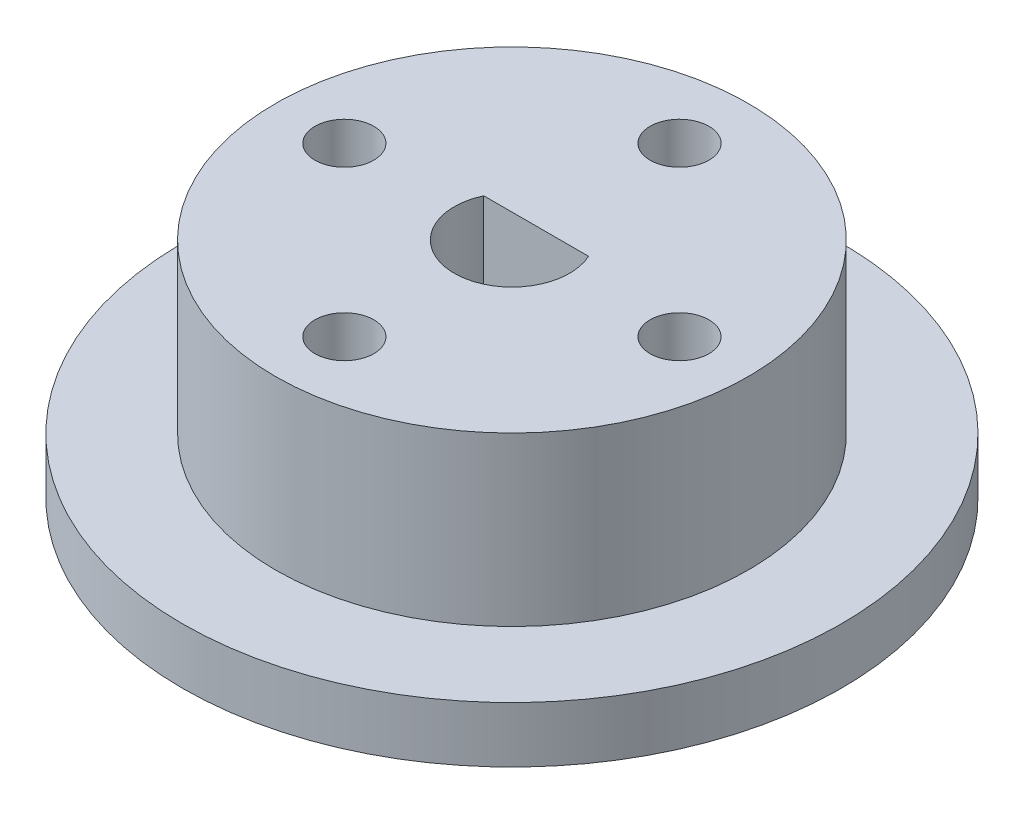
ISO-10303-21;
HEADER;
FILE_DESCRIPTION(('STEP AP214'),'2;1');
FILE_NAME('part.step','',(''),(''),'','','');
FILE_SCHEMA(('AUTOMOTIVE_DESIGN { 1 0 10303 214 1 1 1 1 }'));
ENDSEC;
DATA;
#1=APPLICATION_CONTEXT('core data for automotive mechanical design processes');
#2=APPLICATION_PROTOCOL_DEFINITION('international standard','automotive_design',2000,#1);
#3=PRODUCT_CONTEXT('',#1,'mechanical');
#4=PRODUCT('Part','Part','',(#3));
#5=PRODUCT_RELATED_PRODUCT_CATEGORY('part','',(#4));
#6=PRODUCT_DEFINITION_FORMATION('','',#4);
#7=PRODUCT_DEFINITION_CONTEXT('part definition',#1,'design');
#8=PRODUCT_DEFINITION('design','',#6,#7);
#9=PRODUCT_DEFINITION_SHAPE('','',#8);
#10=(LENGTH_UNIT() NAMED_UNIT(*) SI_UNIT(.MILLI.,.METRE.));
#11=(NAMED_UNIT(*) PLANE_ANGLE_UNIT() SI_UNIT($,.RADIAN.));
#12=(NAMED_UNIT(*) SI_UNIT($,.STERADIAN.) SOLID_ANGLE_UNIT());
#13=UNCERTAINTY_MEASURE_WITH_UNIT(LENGTH_MEASURE(1.E-05),#10,'distance_accuracy_value','');
#14=(GEOMETRIC_REPRESENTATION_CONTEXT(3) GLOBAL_UNCERTAINTY_ASSIGNED_CONTEXT((#13)) GLOBAL_UNIT_ASSIGNED_CONTEXT((#10,
#11,#12)) REPRESENTATION_CONTEXT('',''));
#15=CARTESIAN_POINT('',(0.,0.,0.));
#16=DIRECTION('',(0.,0.,1.));
#17=DIRECTION('',(1.,0.,0.));
#18=AXIS2_PLACEMENT_3D('',#15,#16,#17);
#19=CARTESIAN_POINT('',(0.,9.,0.));
#20=DIRECTION('',(0.,-1.,0.));
#21=DIRECTION('',(0.,0.,-1.));
#22=AXIS2_PLACEMENT_3D('',#19,#20,#21);
#23=CYLINDRICAL_SURFACE('',#22,3.1);
#24=DIRECTION('',(0.,-1.,0.));
#25=VECTOR('',#24,1.);
#26=CARTESIAN_POINT('',(-2.81424945589406,9.,-1.3));
#27=LINE('',#26,#25);
#28=CARTESIAN_POINT('',(-2.81424945589406,9.,-1.3));
#29=VERTEX_POINT('',#28);
#30=CARTESIAN_POINT('',(-2.81424945589406,2.5,-1.3));
#31=VERTEX_POINT('',#30);
#32=EDGE_CURVE('E55',#29,#31,#27,.T.);
#33=ORIENTED_EDGE('',*,*,#32,.F.);
#34=CARTESIAN_POINT('',(0.,9.,0.));
#35=DIRECTION('',(0.,1.,0.));
#36=DIRECTION('',(0.,0.,1.));
#37=AXIS2_PLACEMENT_3D('',#34,#35,#36);
#38=CIRCLE('',#37,3.1);
#39=CARTESIAN_POINT('',(2.81424945589406,9.,-1.3));
#40=VERTEX_POINT('',#39);
#41=EDGE_CURVE('E72',#29,#40,#38,.T.);
#42=ORIENTED_EDGE('',*,*,#41,.T.);
#43=DIRECTION('',(0.,-1.,0.));
#44=VECTOR('',#43,1.);
#45=CARTESIAN_POINT('',(2.81424945589406,9.,-1.3));
#46=LINE('',#45,#44);
#47=CARTESIAN_POINT('',(2.81424945589406,2.5,-1.3));
#48=VERTEX_POINT('',#47);
#49=EDGE_CURVE('E59',#48,#40,#46,.F.);
#50=ORIENTED_EDGE('',*,*,#49,.F.);
#51=CARTESIAN_POINT('',(0.,2.5,0.));
#52=DIRECTION('',(0.,-1.,0.));
#53=DIRECTION('',(0.,0.,-1.));
#54=AXIS2_PLACEMENT_3D('',#51,#52,#53);
#55=CIRCLE('',#54,3.1);
#56=EDGE_CURVE('E70',#48,#31,#55,.T.);
#57=ORIENTED_EDGE('',*,*,#56,.T.);
#58=EDGE_LOOP('',(#33,#42,#50,#57));
#59=FACE_BOUND('',#58,.T.);
#60=ADVANCED_FACE('F39',(#59),#23,.F.);
#61=CARTESIAN_POINT('',(0.,9.,0.));
#62=DIRECTION('',(0.,-1.,0.));
#63=DIRECTION('',(0.,0.,-1.));
#64=AXIS2_PLACEMENT_3D('',#61,#62,#63);
#65=CYLINDRICAL_SURFACE('',#64,12.7);
#66=CARTESIAN_POINT('',(0.,9.,0.));
#67=DIRECTION('',(0.,1.,0.));
#68=DIRECTION('',(0.,0.,1.));
#69=AXIS2_PLACEMENT_3D('',#66,#67,#68);
#70=CIRCLE('',#69,12.7);
#71=CARTESIAN_POINT('',(0.,9.,12.7));
#72=VERTEX_POINT('',#71);
#73=EDGE_CURVE('E48',#72,#72,#70,.T.);
#74=ORIENTED_EDGE('',*,*,#73,.F.);
#75=EDGE_LOOP('',(#74));
#76=FACE_BOUND('',#75,.T.);
#77=CARTESIAN_POINT('',(0.,0.,0.));
#78=DIRECTION('',(0.,1.,0.));
#79=DIRECTION('',(0.,0.,1.));
#80=AXIS2_PLACEMENT_3D('',#77,#78,#79);
#81=CIRCLE('',#80,12.7);
#82=CARTESIAN_POINT('',(0.,0.,12.7));
#83=VERTEX_POINT('',#82);
#84=EDGE_CURVE('E121',#83,#83,#81,.T.);
#85=ORIENTED_EDGE('',*,*,#84,.T.);
#86=EDGE_LOOP('',(#85));
#87=FACE_BOUND('',#86,.T.);
#88=ADVANCED_FACE('F41',(#76,#87),#65,.T.);
#89=CARTESIAN_POINT('',(0.,9.,0.));
#90=DIRECTION('',(0.,1.,0.));
#91=DIRECTION('',(0.,0.,1.));
#92=AXIS2_PLACEMENT_3D('',#89,#90,#91);
#93=PLANE('',#92);
#94=ORIENTED_EDGE('',*,*,#41,.F.);
#95=DIRECTION('',(1.,0.,0.));
#96=VECTOR('',#95,1.);
#97=CARTESIAN_POINT('',(-3.1,9.,-1.3));
#98=LINE('',#97,#96);
#99=EDGE_CURVE('E74',#29,#40,#98,.T.);
#100=ORIENTED_EDGE('',*,*,#99,.T.);
#101=EDGE_LOOP('',(#94,#100));
#102=FACE_BOUND('',#101,.T.);
#103=CARTESIAN_POINT('',(-9.,9.,0.));
#104=DIRECTION('',(0.,1.,0.));
#105=DIRECTION('',(0.,0.,1.));
#106=AXIS2_PLACEMENT_3D('',#103,#104,#105);
#107=CIRCLE('',#106,1.58);
#108=CARTESIAN_POINT('',(-9.,9.,1.58));
#109=VERTEX_POINT('',#108);
#110=EDGE_CURVE('E103',#109,#109,#107,.T.);
#111=ORIENTED_EDGE('',*,*,#110,.F.);
#112=EDGE_LOOP('',(#111));
#113=FACE_BOUND('',#112,.T.);
#114=CARTESIAN_POINT('',(9.,9.,0.));
#115=DIRECTION('',(0.,1.,0.));
#116=DIRECTION('',(0.,0.,-1.));
#117=AXIS2_PLACEMENT_3D('',#114,#115,#116);
#118=CIRCLE('',#117,1.58);
#119=CARTESIAN_POINT('',(9.,9.,-1.58));
#120=VERTEX_POINT('',#119);
#121=EDGE_CURVE('E104',#120,#120,#118,.T.);
#122=ORIENTED_EDGE('',*,*,#121,.F.);
#123=EDGE_LOOP('',(#122));
#124=FACE_BOUND('',#123,.T.);
#125=CARTESIAN_POINT('',(0.,9.,-9.));
#126=DIRECTION('',(0.,1.,0.));
#127=DIRECTION('',(0.,0.,1.));
#128=AXIS2_PLACEMENT_3D('',#125,#126,#127);
#129=CIRCLE('',#128,1.58);
#130=CARTESIAN_POINT('',(0.,9.,-7.42));
#131=VERTEX_POINT('',#130);
#132=EDGE_CURVE('E91',#131,#131,#129,.T.);
#133=ORIENTED_EDGE('',*,*,#132,.F.);
#134=EDGE_LOOP('',(#133));
#135=FACE_BOUND('',#134,.T.);
#136=CARTESIAN_POINT('',(0.,9.,9.));
#137=DIRECTION('',(0.,1.,0.));
#138=DIRECTION('',(0.,0.,-1.));
#139=AXIS2_PLACEMENT_3D('',#136,#137,#138);
#140=CIRCLE('',#139,1.58);
#141=CARTESIAN_POINT('',(0.,9.,7.42));
#142=VERTEX_POINT('',#141);
#143=EDGE_CURVE('E83',#142,#142,#140,.T.);
#144=ORIENTED_EDGE('',*,*,#143,.F.);
#145=EDGE_LOOP('',(#144));
#146=FACE_BOUND('',#145,.T.);
#147=ORIENTED_EDGE('',*,*,#73,.T.);
#148=EDGE_LOOP('',(#147));
#149=FACE_BOUND('',#148,.T.);
#150=ADVANCED_FACE('F142',(#102,#113,#124,#135,#146,#149),#93,.T.);
#151=CARTESIAN_POINT('',(0.,-3.,0.));
#152=DIRECTION('',(0.,1.,0.));
#153=DIRECTION('',(0.,0.,1.));
#154=AXIS2_PLACEMENT_3D('',#151,#152,#153);
#155=CYLINDRICAL_SURFACE('',#154,17.7);
#156=CARTESIAN_POINT('',(0.,-3.,0.));
#157=DIRECTION('',(0.,1.,0.));
#158=DIRECTION('',(0.,0.,1.));
#159=AXIS2_PLACEMENT_3D('',#156,#157,#158);
#160=CIRCLE('',#159,17.7);
#161=CARTESIAN_POINT('',(0.,-3.,17.7));
#162=VERTEX_POINT('',#161);
#163=EDGE_CURVE('E117',#162,#162,#160,.T.);
#164=ORIENTED_EDGE('',*,*,#163,.T.);
#165=EDGE_LOOP('',(#164));
#166=FACE_BOUND('',#165,.T.);
#167=CARTESIAN_POINT('',(0.,0.,0.));
#168=DIRECTION('',(0.,1.,0.));
#169=DIRECTION('',(0.,0.,1.));
#170=AXIS2_PLACEMENT_3D('',#167,#168,#169);
#171=CIRCLE('',#170,17.7);
#172=CARTESIAN_POINT('',(0.,0.,17.7));
#173=VERTEX_POINT('',#172);
#174=EDGE_CURVE('E116',#173,#173,#171,.T.);
#175=ORIENTED_EDGE('',*,*,#174,.F.);
#176=EDGE_LOOP('',(#175));
#177=FACE_BOUND('',#176,.T.);
#178=ADVANCED_FACE('F140',(#166,#177),#155,.T.);
#179=CARTESIAN_POINT('',(0.,-3.,0.));
#180=DIRECTION('',(0.,1.,0.));
#181=DIRECTION('',(0.,0.,1.));
#182=AXIS2_PLACEMENT_3D('',#179,#180,#181);
#183=PLANE('',#182);
#184=CARTESIAN_POINT('',(-9.,-3.,0.));
#185=DIRECTION('',(0.,1.,0.));
#186=DIRECTION('',(0.,0.,1.));
#187=AXIS2_PLACEMENT_3D('',#184,#185,#186);
#188=CIRCLE('',#187,1.58);
#189=CARTESIAN_POINT('',(-9.,-3.,1.58));
#190=VERTEX_POINT('',#189);
#191=EDGE_CURVE('E99',#190,#190,#188,.T.);
#192=ORIENTED_EDGE('',*,*,#191,.T.);
#193=EDGE_LOOP('',(#192));
#194=FACE_BOUND('',#193,.T.);
#195=CARTESIAN_POINT('',(9.,-3.,0.));
#196=DIRECTION('',(0.,1.,0.));
#197=DIRECTION('',(0.,0.,-1.));
#198=AXIS2_PLACEMENT_3D('',#195,#196,#197);
#199=CIRCLE('',#198,1.58);
#200=CARTESIAN_POINT('',(9.,-3.,-1.58));
#201=VERTEX_POINT('',#200);
#202=EDGE_CURVE('E94',#201,#201,#199,.T.);
#203=ORIENTED_EDGE('',*,*,#202,.T.);
#204=EDGE_LOOP('',(#203));
#205=FACE_BOUND('',#204,.T.);
#206=CARTESIAN_POINT('',(0.,-3.,-9.));
#207=DIRECTION('',(0.,1.,0.));
#208=DIRECTION('',(0.,0.,1.));
#209=AXIS2_PLACEMENT_3D('',#206,#207,#208);
#210=CIRCLE('',#209,1.58);
#211=CARTESIAN_POINT('',(0.,-3.,-7.42));
#212=VERTEX_POINT('',#211);
#213=EDGE_CURVE('E87',#212,#212,#210,.T.);
#214=ORIENTED_EDGE('',*,*,#213,.T.);
#215=EDGE_LOOP('',(#214));
#216=FACE_BOUND('',#215,.T.);
#217=CARTESIAN_POINT('',(0.,-3.,9.));
#218=DIRECTION('',(0.,1.,0.));
#219=DIRECTION('',(0.,0.,-1.));
#220=AXIS2_PLACEMENT_3D('',#217,#218,#219);
#221=CIRCLE('',#220,1.58);
#222=CARTESIAN_POINT('',(0.,-3.,7.42));
#223=VERTEX_POINT('',#222);
#224=EDGE_CURVE('E78',#223,#223,#221,.T.);
#225=ORIENTED_EDGE('',*,*,#224,.T.);
#226=EDGE_LOOP('',(#225));
#227=FACE_BOUND('',#226,.T.);
#228=ORIENTED_EDGE('',*,*,#163,.F.);
#229=EDGE_LOOP('',(#228));
#230=FACE_BOUND('',#229,.T.);
#231=ADVANCED_FACE('F136',(#194,#205,#216,#227,#230),#183,.F.);
#232=CARTESIAN_POINT('',(0.,0.,0.));
#233=DIRECTION('',(0.,1.,0.));
#234=DIRECTION('',(0.,0.,1.));
#235=AXIS2_PLACEMENT_3D('',#232,#233,#234);
#236=PLANE('',#235);
#237=ORIENTED_EDGE('',*,*,#84,.F.);
#238=EDGE_LOOP('',(#237));
#239=FACE_BOUND('',#238,.T.);
#240=ORIENTED_EDGE('',*,*,#174,.T.);
#241=EDGE_LOOP('',(#240));
#242=FACE_BOUND('',#241,.T.);
#243=ADVANCED_FACE('F132',(#239,#242),#236,.T.);
#244=CARTESIAN_POINT('',(0.,9.,9.));
#245=DIRECTION('',(0.,-1.,0.));
#246=DIRECTION('',(0.,0.,-1.));
#247=AXIS2_PLACEMENT_3D('',#244,#245,#246);
#248=CYLINDRICAL_SURFACE('',#247,1.58);
#249=ORIENTED_EDGE('',*,*,#143,.T.);
#250=EDGE_LOOP('',(#249));
#251=FACE_BOUND('',#250,.T.);
#252=ORIENTED_EDGE('',*,*,#224,.F.);
#253=EDGE_LOOP('',(#252));
#254=FACE_BOUND('',#253,.T.);
#255=ADVANCED_FACE('F135',(#251,#254),#248,.F.);
#256=CARTESIAN_POINT('',(0.,9.,-9.));
#257=DIRECTION('',(0.,-1.,0.));
#258=DIRECTION('',(0.,0.,-1.));
#259=AXIS2_PLACEMENT_3D('',#256,#257,#258);
#260=CYLINDRICAL_SURFACE('',#259,1.58);
#261=ORIENTED_EDGE('',*,*,#132,.T.);
#262=EDGE_LOOP('',(#261));
#263=FACE_BOUND('',#262,.T.);
#264=ORIENTED_EDGE('',*,*,#213,.F.);
#265=EDGE_LOOP('',(#264));
#266=FACE_BOUND('',#265,.T.);
#267=ADVANCED_FACE('F163',(#263,#266),#260,.F.);
#268=CARTESIAN_POINT('',(9.,9.,0.));
#269=DIRECTION('',(0.,-1.,0.));
#270=DIRECTION('',(0.,0.,-1.));
#271=AXIS2_PLACEMENT_3D('',#268,#269,#270);
#272=CYLINDRICAL_SURFACE('',#271,1.58);
#273=ORIENTED_EDGE('',*,*,#121,.T.);
#274=EDGE_LOOP('',(#273));
#275=FACE_BOUND('',#274,.T.);
#276=ORIENTED_EDGE('',*,*,#202,.F.);
#277=EDGE_LOOP('',(#276));
#278=FACE_BOUND('',#277,.T.);
#279=ADVANCED_FACE('F159',(#275,#278),#272,.F.);
#280=CARTESIAN_POINT('',(-9.,9.,0.));
#281=DIRECTION('',(0.,-1.,0.));
#282=DIRECTION('',(0.,0.,-1.));
#283=AXIS2_PLACEMENT_3D('',#280,#281,#282);
#284=CYLINDRICAL_SURFACE('',#283,1.58);
#285=ORIENTED_EDGE('',*,*,#110,.T.);
#286=EDGE_LOOP('',(#285));
#287=FACE_BOUND('',#286,.T.);
#288=ORIENTED_EDGE('',*,*,#191,.F.);
#289=EDGE_LOOP('',(#288));
#290=FACE_BOUND('',#289,.T.);
#291=ADVANCED_FACE('F162',(#287,#290),#284,.F.);
#292=CARTESIAN_POINT('',(0.,2.5,0.));
#293=DIRECTION('',(0.,-1.,0.));
#294=DIRECTION('',(0.,0.,-1.));
#295=AXIS2_PLACEMENT_3D('',#292,#293,#294);
#296=PLANE('',#295);
#297=ORIENTED_EDGE('',*,*,#56,.F.);
#298=DIRECTION('',(-1.,0.,0.));
#299=VECTOR('',#298,1.);
#300=CARTESIAN_POINT('',(0.,2.5,-1.3));
#301=LINE('',#300,#299);
#302=EDGE_CURVE('E11',#48,#31,#301,.T.);
#303=ORIENTED_EDGE('',*,*,#302,.T.);
#304=EDGE_LOOP('',(#297,#303));
#305=FACE_BOUND('',#304,.T.);
#306=ADVANCED_FACE('F76',(#305),#296,.F.);
#307=CARTESIAN_POINT('',(-3.1,-3.95600495662759,-1.3));
#308=DIRECTION('',(0.,0.,1.));
#309=DIRECTION('',(1.,0.,0.));
#310=AXIS2_PLACEMENT_3D('',#307,#308,#309);
#311=PLANE('',#310);
#312=ORIENTED_EDGE('',*,*,#99,.F.);
#313=ORIENTED_EDGE('',*,*,#32,.T.);
#314=ORIENTED_EDGE('',*,*,#302,.F.);
#315=ORIENTED_EDGE('',*,*,#49,.T.);
#316=EDGE_LOOP('',(#312,#313,#314,#315));
#317=FACE_BOUND('',#316,.T.);
#318=ADVANCED_FACE('F64',(#317),#311,.T.);
#319=CLOSED_SHELL('',(#60,#88,#150,#178,#231,#243,#255,#267,#279,#291,#306,#318));
#320=MANIFOLD_SOLID_BREP('B2',#319);
#321=ADVANCED_BREP_SHAPE_REPRESENTATION('',(#18,#320),#14);
#322=SHAPE_DEFINITION_REPRESENTATION(#9,#321);
ENDSEC;
END-ISO-10303-21;
